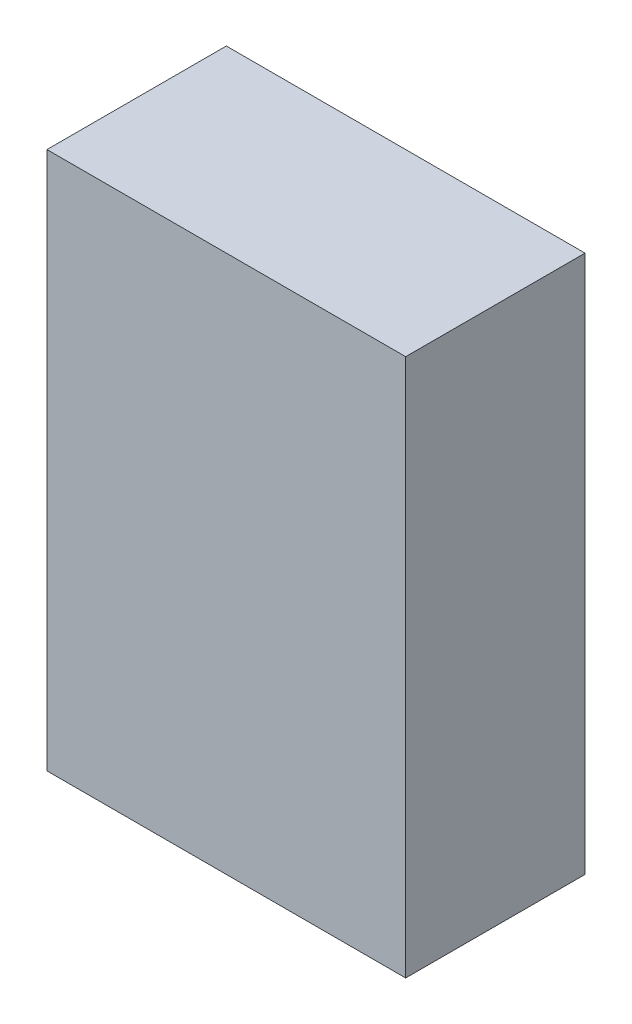
ISO-10303-21;
HEADER;
FILE_DESCRIPTION(('STEP AP214'),'2;1');
FILE_NAME('part.step','',(''),(''),'','','');
FILE_SCHEMA(('AUTOMOTIVE_DESIGN { 1 0 10303 214 1 1 1 1 }'));
ENDSEC;
DATA;
#1=APPLICATION_CONTEXT('core data for automotive mechanical design processes');
#2=APPLICATION_PROTOCOL_DEFINITION('international standard','automotive_design',2000,#1);
#3=PRODUCT_CONTEXT('',#1,'mechanical');
#4=PRODUCT('Part','Part','',(#3));
#5=PRODUCT_RELATED_PRODUCT_CATEGORY('part','',(#4));
#6=PRODUCT_DEFINITION_FORMATION('','',#4);
#7=PRODUCT_DEFINITION_CONTEXT('part definition',#1,'design');
#8=PRODUCT_DEFINITION('design','',#6,#7);
#9=PRODUCT_DEFINITION_SHAPE('','',#8);
#10=(LENGTH_UNIT() NAMED_UNIT(*) SI_UNIT(.MILLI.,.METRE.));
#11=(NAMED_UNIT(*) PLANE_ANGLE_UNIT() SI_UNIT($,.RADIAN.));
#12=(NAMED_UNIT(*) SI_UNIT($,.STERADIAN.) SOLID_ANGLE_UNIT());
#13=UNCERTAINTY_MEASURE_WITH_UNIT(LENGTH_MEASURE(1.E-05),#10,'distance_accuracy_value','');
#14=(GEOMETRIC_REPRESENTATION_CONTEXT(3) GLOBAL_UNCERTAINTY_ASSIGNED_CONTEXT((#13)) GLOBAL_UNIT_ASSIGNED_CONTEXT((#10,
#11,#12)) REPRESENTATION_CONTEXT('',''));
#15=CARTESIAN_POINT('',(0.,0.,0.));
#16=DIRECTION('',(0.,0.,1.));
#17=DIRECTION('',(1.,0.,0.));
#18=AXIS2_PLACEMENT_3D('',#15,#16,#17);
#19=CARTESIAN_POINT('',(-1.49999954,-2.25000058,1.49999954));
#20=DIRECTION('',(0.,0.,1.));
#21=DIRECTION('',(1.,0.,0.));
#22=AXIS2_PLACEMENT_3D('',#19,#20,#21);
#23=PLANE('',#22);
#24=DIRECTION('',(1.,0.,0.));
#25=VECTOR('',#24,1.);
#26=CARTESIAN_POINT('',(-1.49999954,2.25000058,1.49999954));
#27=LINE('',#26,#25);
#28=CARTESIAN_POINT('',(-1.49999954,2.25000058,1.49999954));
#29=VERTEX_POINT('',#28);
#30=CARTESIAN_POINT('',(1.49999954,2.25000058,1.49999954));
#31=VERTEX_POINT('',#30);
#32=EDGE_CURVE('E53',#29,#31,#27,.T.);
#33=ORIENTED_EDGE('',*,*,#32,.F.);
#34=DIRECTION('',(0.,1.,0.));
#35=VECTOR('',#34,1.);
#36=CARTESIAN_POINT('',(-1.49999954,-2.25000058,1.49999954));
#37=LINE('',#36,#35);
#38=CARTESIAN_POINT('',(-1.49999954,-2.25000058,1.49999954));
#39=VERTEX_POINT('',#38);
#40=EDGE_CURVE('E68',#39,#29,#37,.T.);
#41=ORIENTED_EDGE('',*,*,#40,.F.);
#42=DIRECTION('',(1.,0.,0.));
#43=VECTOR('',#42,1.);
#44=CARTESIAN_POINT('',(1.49999954,-2.25000058,1.49999954));
#45=LINE('',#44,#43);
#46=CARTESIAN_POINT('',(1.49999954,-2.25000058,1.49999954));
#47=VERTEX_POINT('',#46);
#48=EDGE_CURVE('E20',#47,#39,#45,.F.);
#49=ORIENTED_EDGE('',*,*,#48,.F.);
#50=DIRECTION('',(0.,1.,0.));
#51=VECTOR('',#50,1.);
#52=CARTESIAN_POINT('',(1.49999954,2.25000058,1.49999954));
#53=LINE('',#52,#51);
#54=EDGE_CURVE('E58',#31,#47,#53,.F.);
#55=ORIENTED_EDGE('',*,*,#54,.F.);
#56=EDGE_LOOP('',(#33,#41,#49,#55));
#57=FACE_BOUND('',#56,.T.);
#58=ADVANCED_FACE('F17',(#57),#23,.T.);
#59=CARTESIAN_POINT('',(1.49999954,-2.25000058,0.));
#60=DIRECTION('',(0.,-1.,0.));
#61=DIRECTION('',(0.,0.,-1.));
#62=AXIS2_PLACEMENT_3D('',#59,#60,#61);
#63=PLANE('',#62);
#64=DIRECTION('',(0.,0.,1.));
#65=VECTOR('',#64,1.);
#66=CARTESIAN_POINT('',(-1.49999954,-2.25000058,0.));
#67=LINE('',#66,#65);
#68=CARTESIAN_POINT('',(-1.49999954,-2.25000058,0.));
#69=VERTEX_POINT('',#68);
#70=EDGE_CURVE('E79',#69,#39,#67,.T.);
#71=ORIENTED_EDGE('',*,*,#70,.F.);
#72=DIRECTION('',(1.,0.,0.));
#73=VECTOR('',#72,1.);
#74=CARTESIAN_POINT('',(-1.49999954,-2.25000058,0.));
#75=LINE('',#74,#73);
#76=CARTESIAN_POINT('',(1.49999954,-2.25000058,0.));
#77=VERTEX_POINT('',#76);
#78=EDGE_CURVE('E74',#69,#77,#75,.T.);
#79=ORIENTED_EDGE('',*,*,#78,.T.);
#80=DIRECTION('',(0.,0.,-1.));
#81=VECTOR('',#80,1.);
#82=CARTESIAN_POINT('',(1.49999954,-2.25000058,0.));
#83=LINE('',#82,#81);
#84=EDGE_CURVE('E63',#47,#77,#83,.T.);
#85=ORIENTED_EDGE('',*,*,#84,.F.);
#86=ORIENTED_EDGE('',*,*,#48,.T.);
#87=EDGE_LOOP('',(#71,#79,#85,#86));
#88=FACE_BOUND('',#87,.T.);
#89=ADVANCED_FACE('F73',(#88),#63,.T.);
#90=CARTESIAN_POINT('',(1.49999954,2.25000058,0.));
#91=DIRECTION('',(1.,0.,0.));
#92=DIRECTION('',(0.,0.,-1.));
#93=AXIS2_PLACEMENT_3D('',#90,#91,#92);
#94=PLANE('',#93);
#95=ORIENTED_EDGE('',*,*,#84,.T.);
#96=DIRECTION('',(0.,1.,0.));
#97=VECTOR('',#96,1.);
#98=CARTESIAN_POINT('',(1.49999954,-2.25000058,0.));
#99=LINE('',#98,#97);
#100=CARTESIAN_POINT('',(1.49999954,2.25000058,0.));
#101=VERTEX_POINT('',#100);
#102=EDGE_CURVE('E84',#77,#101,#99,.T.);
#103=ORIENTED_EDGE('',*,*,#102,.T.);
#104=DIRECTION('',(0.,0.,1.));
#105=VECTOR('',#104,1.);
#106=CARTESIAN_POINT('',(1.49999954,2.25000058,0.));
#107=LINE('',#106,#105);
#108=EDGE_CURVE('E65',#31,#101,#107,.F.);
#109=ORIENTED_EDGE('',*,*,#108,.F.);
#110=ORIENTED_EDGE('',*,*,#54,.T.);
#111=EDGE_LOOP('',(#95,#103,#109,#110));
#112=FACE_BOUND('',#111,.T.);
#113=ADVANCED_FACE('F60',(#112),#94,.T.);
#114=CARTESIAN_POINT('',(-1.49999954,2.25000058,0.));
#115=DIRECTION('',(0.,1.,0.));
#116=DIRECTION('',(0.,0.,1.));
#117=AXIS2_PLACEMENT_3D('',#114,#115,#116);
#118=PLANE('',#117);
#119=ORIENTED_EDGE('',*,*,#108,.T.);
#120=DIRECTION('',(1.,0.,0.));
#121=VECTOR('',#120,1.);
#122=CARTESIAN_POINT('',(-1.49999954,2.25000058,0.));
#123=LINE('',#122,#121);
#124=CARTESIAN_POINT('',(-1.49999954,2.25000058,0.));
#125=VERTEX_POINT('',#124);
#126=EDGE_CURVE('E26',#101,#125,#123,.F.);
#127=ORIENTED_EDGE('',*,*,#126,.T.);
#128=DIRECTION('',(0.,0.,1.));
#129=VECTOR('',#128,1.);
#130=CARTESIAN_POINT('',(-1.49999954,2.25000058,0.));
#131=LINE('',#130,#129);
#132=EDGE_CURVE('E34',#29,#125,#131,.F.);
#133=ORIENTED_EDGE('',*,*,#132,.F.);
#134=ORIENTED_EDGE('',*,*,#32,.T.);
#135=EDGE_LOOP('',(#119,#127,#133,#134));
#136=FACE_BOUND('',#135,.T.);
#137=ADVANCED_FACE('F88',(#136),#118,.T.);
#138=CARTESIAN_POINT('',(-1.49999954,-2.25000058,0.));
#139=DIRECTION('',(-1.,0.,0.));
#140=DIRECTION('',(0.,0.,1.));
#141=AXIS2_PLACEMENT_3D('',#138,#139,#140);
#142=PLANE('',#141);
#143=ORIENTED_EDGE('',*,*,#132,.T.);
#144=DIRECTION('',(0.,1.,0.));
#145=VECTOR('',#144,1.);
#146=CARTESIAN_POINT('',(-1.49999954,-2.25000058,0.));
#147=LINE('',#146,#145);
#148=EDGE_CURVE('E11',#125,#69,#147,.F.);
#149=ORIENTED_EDGE('',*,*,#148,.T.);
#150=ORIENTED_EDGE('',*,*,#70,.T.);
#151=ORIENTED_EDGE('',*,*,#40,.T.);
#152=EDGE_LOOP('',(#143,#149,#150,#151));
#153=FACE_BOUND('',#152,.T.);
#154=ADVANCED_FACE('F91',(#153),#142,.T.);
#155=CARTESIAN_POINT('',(-1.49999954,-2.25000058,0.));
#156=DIRECTION('',(0.,0.,1.));
#157=DIRECTION('',(1.,0.,0.));
#158=AXIS2_PLACEMENT_3D('',#155,#156,#157);
#159=PLANE('',#158);
#160=ORIENTED_EDGE('',*,*,#126,.F.);
#161=ORIENTED_EDGE('',*,*,#102,.F.);
#162=ORIENTED_EDGE('',*,*,#78,.F.);
#163=ORIENTED_EDGE('',*,*,#148,.F.);
#164=EDGE_LOOP('',(#160,#161,#162,#163));
#165=FACE_BOUND('',#164,.T.);
#166=ADVANCED_FACE('F90',(#165),#159,.F.);
#167=CLOSED_SHELL('',(#58,#89,#113,#137,#154,#166));
#168=MANIFOLD_SOLID_BREP('B1',#167);
#169=ADVANCED_BREP_SHAPE_REPRESENTATION('',(#18,#168),#14);
#170=SHAPE_DEFINITION_REPRESENTATION(#9,#169);
ENDSEC;
END-ISO-10303-21;
